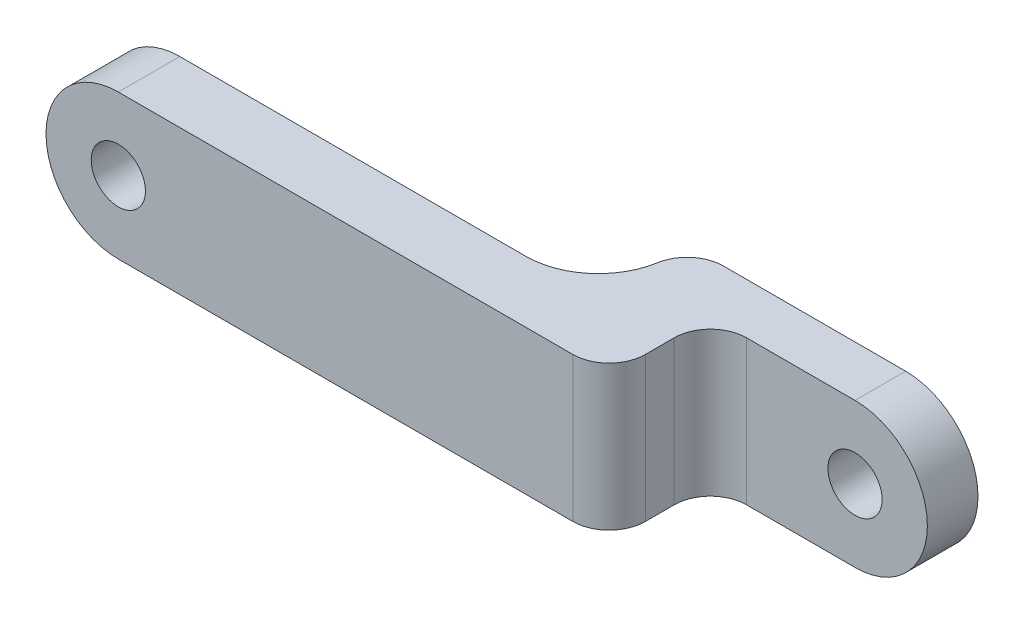
ISO-10303-21;
HEADER;
FILE_DESCRIPTION(('STEP AP214'),'2;1');
FILE_NAME('part.step','',(''),(''),'','','');
FILE_SCHEMA(('AUTOMOTIVE_DESIGN { 1 0 10303 214 1 1 1 1 }'));
ENDSEC;
DATA;
#1=APPLICATION_CONTEXT('core data for automotive mechanical design processes');
#2=APPLICATION_PROTOCOL_DEFINITION('international standard','automotive_design',2000,#1);
#3=PRODUCT_CONTEXT('',#1,'mechanical');
#4=PRODUCT('Part','Part','',(#3));
#5=PRODUCT_RELATED_PRODUCT_CATEGORY('part','',(#4));
#6=PRODUCT_DEFINITION_FORMATION('','',#4);
#7=PRODUCT_DEFINITION_CONTEXT('part definition',#1,'design');
#8=PRODUCT_DEFINITION('design','',#6,#7);
#9=PRODUCT_DEFINITION_SHAPE('','',#8);
#10=(LENGTH_UNIT() NAMED_UNIT(*) SI_UNIT(.MILLI.,.METRE.));
#11=(NAMED_UNIT(*) PLANE_ANGLE_UNIT() SI_UNIT($,.RADIAN.));
#12=(NAMED_UNIT(*) SI_UNIT($,.STERADIAN.) SOLID_ANGLE_UNIT());
#13=UNCERTAINTY_MEASURE_WITH_UNIT(LENGTH_MEASURE(1.E-05),#10,'distance_accuracy_value','');
#14=(GEOMETRIC_REPRESENTATION_CONTEXT(3) GLOBAL_UNCERTAINTY_ASSIGNED_CONTEXT((#13)) GLOBAL_UNIT_ASSIGNED_CONTEXT((#10,
#11,#12)) REPRESENTATION_CONTEXT('',''));
#15=CARTESIAN_POINT('',(0.,0.,0.));
#16=DIRECTION('',(0.,0.,1.));
#17=DIRECTION('',(1.,0.,0.));
#18=AXIS2_PLACEMENT_3D('',#15,#16,#17);
#19=CARTESIAN_POINT('',(0.,0.,0.85));
#20=DIRECTION('',(0.,0.,-1.));
#21=DIRECTION('',(1.,0.,0.));
#22=AXIS2_PLACEMENT_3D('',#19,#20,#21);
#23=CYLINDRICAL_SURFACE('',#22,2.);
#24=CARTESIAN_POINT('',(0.,0.,-1.95));
#25=DIRECTION('',(0.,0.,-1.));
#26=DIRECTION('',(-1.,0.,0.));
#27=AXIS2_PLACEMENT_3D('',#24,#25,#26);
#28=CIRCLE('',#27,2.);
#29=CARTESIAN_POINT('',(0.,2.,-1.95));
#30=VERTEX_POINT('',#29);
#31=CARTESIAN_POINT('',(0.,-2.,-1.95));
#32=VERTEX_POINT('',#31);
#33=EDGE_CURVE('E127',#30,#32,#28,.T.);
#34=ORIENTED_EDGE('',*,*,#33,.T.);
#35=DIRECTION('',(0.,0.,-1.));
#36=VECTOR('',#35,1.);
#37=CARTESIAN_POINT('',(0.,-2.,0.85));
#38=LINE('',#37,#36);
#39=CARTESIAN_POINT('',(0.,-2.,-3.35));
#40=VERTEX_POINT('',#39);
#41=EDGE_CURVE('E133',#32,#40,#38,.T.);
#42=ORIENTED_EDGE('',*,*,#41,.T.);
#43=CARTESIAN_POINT('',(0.,0.,-3.35));
#44=DIRECTION('',(0.,0.,1.));
#45=DIRECTION('',(1.,0.,0.));
#46=AXIS2_PLACEMENT_3D('',#43,#44,#45);
#47=CIRCLE('',#46,2.);
#48=CARTESIAN_POINT('',(0.,2.,-3.35));
#49=VERTEX_POINT('',#48);
#50=EDGE_CURVE('E161',#40,#49,#47,.T.);
#51=ORIENTED_EDGE('',*,*,#50,.T.);
#52=DIRECTION('',(0.,0.,-1.));
#53=VECTOR('',#52,1.);
#54=CARTESIAN_POINT('',(0.,2.,0.85));
#55=LINE('',#54,#53);
#56=EDGE_CURVE('E146',#30,#49,#55,.T.);
#57=ORIENTED_EDGE('',*,*,#56,.F.);
#58=EDGE_LOOP('',(#34,#42,#51,#57));
#59=FACE_BOUND('',#58,.T.);
#60=ADVANCED_FACE('F37',(#59),#23,.T.);
#61=CARTESIAN_POINT('',(0.,0.,0.85));
#62=DIRECTION('',(0.,0.,-1.));
#63=DIRECTION('',(1.,0.,0.));
#64=AXIS2_PLACEMENT_3D('',#61,#62,#63);
#65=CYLINDRICAL_SURFACE('',#64,0.75);
#66=CARTESIAN_POINT('',(0.,0.,-3.35));
#67=DIRECTION('',(0.,0.,1.));
#68=DIRECTION('',(1.,0.,0.));
#69=AXIS2_PLACEMENT_3D('',#66,#67,#68);
#70=CIRCLE('',#69,0.75);
#71=CARTESIAN_POINT('',(0.75,0.,-3.35));
#72=VERTEX_POINT('',#71);
#73=EDGE_CURVE('E157',#72,#72,#70,.T.);
#74=ORIENTED_EDGE('',*,*,#73,.F.);
#75=EDGE_LOOP('',(#74));
#76=FACE_BOUND('',#75,.T.);
#77=CARTESIAN_POINT('',(0.,0.,-1.95));
#78=DIRECTION('',(0.,0.,-1.));
#79=DIRECTION('',(-1.,0.,0.));
#80=AXIS2_PLACEMENT_3D('',#77,#78,#79);
#81=CIRCLE('',#80,0.75);
#82=CARTESIAN_POINT('',(-0.75,0.,-1.95));
#83=VERTEX_POINT('',#82);
#84=EDGE_CURVE('E147',#83,#83,#81,.T.);
#85=ORIENTED_EDGE('',*,*,#84,.F.);
#86=EDGE_LOOP('',(#85));
#87=FACE_BOUND('',#86,.T.);
#88=ADVANCED_FACE('F257',(#76,#87),#65,.F.);
#89=CARTESIAN_POINT('',(0.,0.,-0.85));
#90=DIRECTION('',(0.,0.,1.));
#91=DIRECTION('',(-1.,0.,0.));
#92=AXIS2_PLACEMENT_3D('',#89,#90,#91);
#93=PLANE('',#92);
#94=CARTESIAN_POINT('',(-17.57,0.,-0.85));
#95=DIRECTION('',(0.,0.,-1.));
#96=DIRECTION('',(-1.,0.,0.));
#97=AXIS2_PLACEMENT_3D('',#94,#95,#96);
#98=CIRCLE('',#97,0.750000000000002);
#99=CARTESIAN_POINT('',(-18.32,0.,-0.85));
#100=VERTEX_POINT('',#99);
#101=EDGE_CURVE('E167',#100,#100,#98,.T.);
#102=ORIENTED_EDGE('',*,*,#101,.F.);
#103=EDGE_LOOP('',(#102));
#104=FACE_BOUND('',#103,.T.);
#105=DIRECTION('',(-1.,0.,0.));
#106=VECTOR('',#105,1.);
#107=CARTESIAN_POINT('',(0.,-2.,-0.85));
#108=LINE('',#107,#106);
#109=CARTESIAN_POINT('',(-8.,-2.,-0.85));
#110=VERTEX_POINT('',#109);
#111=CARTESIAN_POINT('',(-17.57,-2.,-0.85));
#112=VERTEX_POINT('',#111);
#113=EDGE_CURVE('E171',#110,#112,#108,.T.);
#114=ORIENTED_EDGE('',*,*,#113,.T.);
#115=CARTESIAN_POINT('',(-17.57,0.,-0.85));
#116=DIRECTION('',(0.,0.,-1.));
#117=DIRECTION('',(-1.,0.,0.));
#118=AXIS2_PLACEMENT_3D('',#115,#116,#117);
#119=CIRCLE('',#118,2.);
#120=CARTESIAN_POINT('',(-17.57,2.,-0.85));
#121=VERTEX_POINT('',#120);
#122=EDGE_CURVE('E185',#112,#121,#119,.T.);
#123=ORIENTED_EDGE('',*,*,#122,.T.);
#124=DIRECTION('',(1.,0.,0.));
#125=VECTOR('',#124,1.);
#126=CARTESIAN_POINT('',(0.,2.,-0.85));
#127=LINE('',#126,#125);
#128=CARTESIAN_POINT('',(-8.,2.,-0.85));
#129=VERTEX_POINT('',#128);
#130=EDGE_CURVE('E177',#121,#129,#127,.T.);
#131=ORIENTED_EDGE('',*,*,#130,.T.);
#132=DIRECTION('',(0.,-1.,0.));
#133=VECTOR('',#132,1.);
#134=CARTESIAN_POINT('',(-8.,2.,-0.85));
#135=LINE('',#134,#133);
#136=EDGE_CURVE('E141',#110,#129,#135,.F.);
#137=ORIENTED_EDGE('',*,*,#136,.F.);
#138=EDGE_LOOP('',(#114,#123,#131,#137));
#139=FACE_BOUND('',#138,.T.);
#140=ADVANCED_FACE('F243',(#104,#139),#93,.F.);
#141=CARTESIAN_POINT('',(0.,0.,0.85));
#142=DIRECTION('',(0.,0.,1.));
#143=DIRECTION('',(-1.,0.,0.));
#144=AXIS2_PLACEMENT_3D('',#141,#142,#143);
#145=PLANE('',#144);
#146=DIRECTION('',(1.,0.,0.));
#147=VECTOR('',#146,1.);
#148=CARTESIAN_POINT('',(0.,2.,0.85));
#149=LINE('',#148,#147);
#150=CARTESIAN_POINT('',(-17.57,2.,0.85));
#151=VERTEX_POINT('',#150);
#152=CARTESIAN_POINT('',(-5.,2.,0.85));
#153=VERTEX_POINT('',#152);
#154=EDGE_CURVE('E180',#151,#153,#149,.T.);
#155=ORIENTED_EDGE('',*,*,#154,.F.);
#156=CARTESIAN_POINT('',(-17.57,0.,0.85));
#157=DIRECTION('',(0.,0.,-1.));
#158=DIRECTION('',(-1.,0.,0.));
#159=AXIS2_PLACEMENT_3D('',#156,#157,#158);
#160=CIRCLE('',#159,2.);
#161=CARTESIAN_POINT('',(-17.57,-2.,0.85));
#162=VERTEX_POINT('',#161);
#163=EDGE_CURVE('E176',#162,#151,#160,.T.);
#164=ORIENTED_EDGE('',*,*,#163,.F.);
#165=DIRECTION('',(-1.,0.,0.));
#166=VECTOR('',#165,1.);
#167=CARTESIAN_POINT('',(0.,-2.,0.85));
#168=LINE('',#167,#166);
#169=CARTESIAN_POINT('',(-5.,-2.,0.85));
#170=VERTEX_POINT('',#169);
#171=EDGE_CURVE('E174',#170,#162,#168,.T.);
#172=ORIENTED_EDGE('',*,*,#171,.F.);
#173=DIRECTION('',(0.,1.,0.));
#174=VECTOR('',#173,1.);
#175=CARTESIAN_POINT('',(-5.,-2.,0.85));
#176=LINE('',#175,#174);
#177=EDGE_CURVE('E217',#153,#170,#176,.F.);
#178=ORIENTED_EDGE('',*,*,#177,.F.);
#179=EDGE_LOOP('',(#155,#164,#172,#178));
#180=FACE_BOUND('',#179,.T.);
#181=CARTESIAN_POINT('',(-17.57,0.,0.85));
#182=DIRECTION('',(0.,0.,-1.));
#183=DIRECTION('',(-1.,0.,0.));
#184=AXIS2_PLACEMENT_3D('',#181,#182,#183);
#185=CIRCLE('',#184,0.750000000000002);
#186=CARTESIAN_POINT('',(-18.32,0.,0.85));
#187=VERTEX_POINT('',#186);
#188=EDGE_CURVE('E168',#187,#187,#185,.T.);
#189=ORIENTED_EDGE('',*,*,#188,.T.);
#190=EDGE_LOOP('',(#189));
#191=FACE_BOUND('',#190,.T.);
#192=ADVANCED_FACE('F233',(#180,#191),#145,.T.);
#193=CARTESIAN_POINT('',(0.,-2.,0.85));
#194=DIRECTION('',(0.,1.,0.));
#195=DIRECTION('',(0.,0.,1.));
#196=AXIS2_PLACEMENT_3D('',#193,#194,#195);
#197=PLANE('',#196);
#198=ORIENTED_EDGE('',*,*,#171,.T.);
#199=DIRECTION('',(0.,0.,-1.));
#200=VECTOR('',#199,1.);
#201=CARTESIAN_POINT('',(-17.57,-2.,0.85));
#202=LINE('',#201,#200);
#203=EDGE_CURVE('E142',#162,#112,#202,.T.);
#204=ORIENTED_EDGE('',*,*,#203,.T.);
#205=ORIENTED_EDGE('',*,*,#113,.F.);
#206=CARTESIAN_POINT('',(-8.,-2.,-2.85));
#207=DIRECTION('',(0.,-1.,0.));
#208=DIRECTION('',(0.,0.,1.));
#209=AXIS2_PLACEMENT_3D('',#206,#207,#208);
#210=CIRCLE('',#209,2.);
#211=CARTESIAN_POINT('',(-6.02797340563346,-2.,-2.51666666666667));
#212=VERTEX_POINT('',#211);
#213=EDGE_CURVE('E196',#212,#110,#210,.T.);
#214=ORIENTED_EDGE('',*,*,#213,.F.);
#215=CARTESIAN_POINT('',(-5.04196010845019,-2.,-2.35));
#216=DIRECTION('',(0.,-1.,0.));
#217=DIRECTION('',(0.,0.,1.));
#218=AXIS2_PLACEMENT_3D('',#215,#216,#217);
#219=CIRCLE('',#218,1.);
#220=CARTESIAN_POINT('',(-5.04196010845019,-2.,-3.35));
#221=VERTEX_POINT('',#220);
#222=EDGE_CURVE('E203',#221,#212,#219,.F.);
#223=ORIENTED_EDGE('',*,*,#222,.F.);
#224=DIRECTION('',(1.,0.,0.));
#225=VECTOR('',#224,1.);
#226=CARTESIAN_POINT('',(-6.,-2.,-3.35));
#227=LINE('',#226,#225);
#228=EDGE_CURVE('E137',#221,#40,#227,.T.);
#229=ORIENTED_EDGE('',*,*,#228,.T.);
#230=ORIENTED_EDGE('',*,*,#41,.F.);
#231=DIRECTION('',(-1.,0.,0.));
#232=VECTOR('',#231,1.);
#233=CARTESIAN_POINT('',(0.,-2.,-1.95));
#234=LINE('',#233,#232);
#235=CARTESIAN_POINT('',(-3.,-2.,-1.95));
#236=VERTEX_POINT('',#235);
#237=EDGE_CURVE('E122',#32,#236,#234,.T.);
#238=ORIENTED_EDGE('',*,*,#237,.T.);
#239=CARTESIAN_POINT('',(-3.,-2.,-0.95));
#240=DIRECTION('',(0.,-1.,0.));
#241=DIRECTION('',(0.,0.,1.));
#242=AXIS2_PLACEMENT_3D('',#239,#240,#241);
#243=CIRCLE('',#242,1.);
#244=CARTESIAN_POINT('',(-4.,-2.,-0.95));
#245=VERTEX_POINT('',#244);
#246=EDGE_CURVE('E11',#245,#236,#243,.T.);
#247=ORIENTED_EDGE('',*,*,#246,.F.);
#248=DIRECTION('',(0.,0.,1.));
#249=VECTOR('',#248,1.);
#250=CARTESIAN_POINT('',(-4.,-2.,-1.95));
#251=LINE('',#250,#249);
#252=CARTESIAN_POINT('',(-4.,-2.,-0.15));
#253=VERTEX_POINT('',#252);
#254=EDGE_CURVE('E153',#245,#253,#251,.T.);
#255=ORIENTED_EDGE('',*,*,#254,.T.);
#256=CARTESIAN_POINT('',(-5.,-2.,-0.15));
#257=DIRECTION('',(0.,-1.,0.));
#258=DIRECTION('',(0.,0.,1.));
#259=AXIS2_PLACEMENT_3D('',#256,#257,#258);
#260=CIRCLE('',#259,1.);
#261=EDGE_CURVE('E52',#170,#253,#260,.F.);
#262=ORIENTED_EDGE('',*,*,#261,.F.);
#263=EDGE_LOOP('',(#198,#204,#205,#214,#223,#229,#230,#238,#247,#255,#262));
#264=FACE_BOUND('',#263,.T.);
#265=ADVANCED_FACE('F134',(#264),#197,.F.);
#266=CARTESIAN_POINT('',(-17.57,0.,0.85));
#267=DIRECTION('',(0.,0.,-1.));
#268=DIRECTION('',(1.,0.,0.));
#269=AXIS2_PLACEMENT_3D('',#266,#267,#268);
#270=CYLINDRICAL_SURFACE('',#269,2.);
#271=ORIENTED_EDGE('',*,*,#122,.F.);
#272=ORIENTED_EDGE('',*,*,#203,.F.);
#273=ORIENTED_EDGE('',*,*,#163,.T.);
#274=DIRECTION('',(0.,0.,-1.));
#275=VECTOR('',#274,1.);
#276=CARTESIAN_POINT('',(-17.57,2.,0.85));
#277=LINE('',#276,#275);
#278=EDGE_CURVE('E191',#151,#121,#277,.T.);
#279=ORIENTED_EDGE('',*,*,#278,.T.);
#280=EDGE_LOOP('',(#271,#272,#273,#279));
#281=FACE_BOUND('',#280,.T.);
#282=ADVANCED_FACE('F239',(#281),#270,.T.);
#283=CARTESIAN_POINT('',(0.,2.,0.85));
#284=DIRECTION('',(0.,-1.,0.));
#285=DIRECTION('',(0.,0.,-1.));
#286=AXIS2_PLACEMENT_3D('',#283,#284,#285);
#287=PLANE('',#286);
#288=DIRECTION('',(0.,0.,1.));
#289=VECTOR('',#288,1.);
#290=CARTESIAN_POINT('',(-4.,2.,-1.95));
#291=LINE('',#290,#289);
#292=CARTESIAN_POINT('',(-4.,2.,-0.95));
#293=VERTEX_POINT('',#292);
#294=CARTESIAN_POINT('',(-4.,2.,-0.15));
#295=VERTEX_POINT('',#294);
#296=EDGE_CURVE('E154',#293,#295,#291,.T.);
#297=ORIENTED_EDGE('',*,*,#296,.F.);
#298=CARTESIAN_POINT('',(-3.,2.,-0.95));
#299=DIRECTION('',(0.,1.,0.));
#300=DIRECTION('',(0.,0.,-1.));
#301=AXIS2_PLACEMENT_3D('',#298,#299,#300);
#302=CIRCLE('',#301,1.);
#303=CARTESIAN_POINT('',(-3.,2.,-1.95));
#304=VERTEX_POINT('',#303);
#305=EDGE_CURVE('E45',#304,#293,#302,.T.);
#306=ORIENTED_EDGE('',*,*,#305,.F.);
#307=DIRECTION('',(1.,0.,0.));
#308=VECTOR('',#307,1.);
#309=CARTESIAN_POINT('',(-4.,2.,-1.95));
#310=LINE('',#309,#308);
#311=EDGE_CURVE('E130',#304,#30,#310,.T.);
#312=ORIENTED_EDGE('',*,*,#311,.T.);
#313=ORIENTED_EDGE('',*,*,#56,.T.);
#314=DIRECTION('',(-1.,0.,0.));
#315=VECTOR('',#314,1.);
#316=CARTESIAN_POINT('',(0.,2.,-3.35));
#317=LINE('',#316,#315);
#318=CARTESIAN_POINT('',(-5.04196010845019,2.,-3.35));
#319=VERTEX_POINT('',#318);
#320=EDGE_CURVE('E163',#49,#319,#317,.T.);
#321=ORIENTED_EDGE('',*,*,#320,.T.);
#322=CARTESIAN_POINT('',(-5.04196010845019,2.,-2.35));
#323=DIRECTION('',(0.,1.,0.));
#324=DIRECTION('',(0.,0.,-1.));
#325=AXIS2_PLACEMENT_3D('',#322,#323,#324);
#326=CIRCLE('',#325,1.);
#327=CARTESIAN_POINT('',(-6.02797340563346,2.,-2.51666666666667));
#328=VERTEX_POINT('',#327);
#329=EDGE_CURVE('E208',#328,#319,#326,.F.);
#330=ORIENTED_EDGE('',*,*,#329,.F.);
#331=CARTESIAN_POINT('',(-8.,2.,-2.85));
#332=DIRECTION('',(0.,1.,0.));
#333=DIRECTION('',(0.,0.,-1.));
#334=AXIS2_PLACEMENT_3D('',#331,#332,#333);
#335=CIRCLE('',#334,2.);
#336=EDGE_CURVE('E198',#129,#328,#335,.T.);
#337=ORIENTED_EDGE('',*,*,#336,.F.);
#338=ORIENTED_EDGE('',*,*,#130,.F.);
#339=ORIENTED_EDGE('',*,*,#278,.F.);
#340=ORIENTED_EDGE('',*,*,#154,.T.);
#341=CARTESIAN_POINT('',(-5.,2.,-0.15));
#342=DIRECTION('',(0.,1.,0.));
#343=DIRECTION('',(0.,0.,-1.));
#344=AXIS2_PLACEMENT_3D('',#341,#342,#343);
#345=CIRCLE('',#344,1.);
#346=EDGE_CURVE('E59',#295,#153,#345,.F.);
#347=ORIENTED_EDGE('',*,*,#346,.F.);
#348=EDGE_LOOP('',(#297,#306,#312,#313,#321,#330,#337,#338,#339,#340,#347));
#349=FACE_BOUND('',#348,.T.);
#350=ADVANCED_FACE('F226',(#349),#287,.F.);
#351=CARTESIAN_POINT('',(-17.57,0.,0.85));
#352=DIRECTION('',(0.,0.,-1.));
#353=DIRECTION('',(1.,0.,0.));
#354=AXIS2_PLACEMENT_3D('',#351,#352,#353);
#355=CYLINDRICAL_SURFACE('',#354,0.750000000000002);
#356=ORIENTED_EDGE('',*,*,#188,.F.);
#357=EDGE_LOOP('',(#356));
#358=FACE_BOUND('',#357,.T.);
#359=ORIENTED_EDGE('',*,*,#101,.T.);
#360=EDGE_LOOP('',(#359));
#361=FACE_BOUND('',#360,.T.);
#362=ADVANCED_FACE('F253',(#358,#361),#355,.F.);
#363=CARTESIAN_POINT('',(0.,0.,-3.35));
#364=DIRECTION('',(0.,0.,-1.));
#365=DIRECTION('',(1.,0.,0.));
#366=AXIS2_PLACEMENT_3D('',#363,#364,#365);
#367=PLANE('',#366);
#368=ORIENTED_EDGE('',*,*,#320,.F.);
#369=ORIENTED_EDGE('',*,*,#50,.F.);
#370=ORIENTED_EDGE('',*,*,#228,.F.);
#371=DIRECTION('',(0.,-1.,0.));
#372=VECTOR('',#371,1.);
#373=CARTESIAN_POINT('',(-5.04196010845019,-2.,-3.35));
#374=LINE('',#373,#372);
#375=EDGE_CURVE('E201',#319,#221,#374,.T.);
#376=ORIENTED_EDGE('',*,*,#375,.F.);
#377=EDGE_LOOP('',(#368,#369,#370,#376));
#378=FACE_BOUND('',#377,.T.);
#379=ORIENTED_EDGE('',*,*,#73,.T.);
#380=EDGE_LOOP('',(#379));
#381=FACE_BOUND('',#380,.T.);
#382=ADVANCED_FACE('F250',(#378,#381),#367,.T.);
#383=CARTESIAN_POINT('',(-4.,2.,-1.95));
#384=DIRECTION('',(-1.,0.,0.));
#385=DIRECTION('',(0.,0.,-1.));
#386=AXIS2_PLACEMENT_3D('',#383,#384,#385);
#387=PLANE('',#386);
#388=ORIENTED_EDGE('',*,*,#296,.T.);
#389=DIRECTION('',(0.,1.,0.));
#390=VECTOR('',#389,1.);
#391=CARTESIAN_POINT('',(-4.,2.,-0.15));
#392=LINE('',#391,#390);
#393=EDGE_CURVE('E212',#253,#295,#392,.T.);
#394=ORIENTED_EDGE('',*,*,#393,.F.);
#395=ORIENTED_EDGE('',*,*,#254,.F.);
#396=DIRECTION('',(0.,1.,0.));
#397=VECTOR('',#396,1.);
#398=CARTESIAN_POINT('',(-4.,2.,-0.95));
#399=LINE('',#398,#397);
#400=EDGE_CURVE('E214',#293,#245,#399,.F.);
#401=ORIENTED_EDGE('',*,*,#400,.F.);
#402=EDGE_LOOP('',(#388,#394,#395,#401));
#403=FACE_BOUND('',#402,.T.);
#404=ADVANCED_FACE('F228',(#403),#387,.F.);
#405=CARTESIAN_POINT('',(0.,0.,-1.95));
#406=DIRECTION('',(0.,0.,1.));
#407=DIRECTION('',(-1.,0.,0.));
#408=AXIS2_PLACEMENT_3D('',#405,#406,#407);
#409=PLANE('',#408);
#410=ORIENTED_EDGE('',*,*,#84,.T.);
#411=EDGE_LOOP('',(#410));
#412=FACE_BOUND('',#411,.T.);
#413=ORIENTED_EDGE('',*,*,#237,.F.);
#414=ORIENTED_EDGE('',*,*,#33,.F.);
#415=ORIENTED_EDGE('',*,*,#311,.F.);
#416=DIRECTION('',(0.,1.,0.));
#417=VECTOR('',#416,1.);
#418=CARTESIAN_POINT('',(-3.,0.,-1.95));
#419=LINE('',#418,#417);
#420=EDGE_CURVE('E128',#236,#304,#419,.T.);
#421=ORIENTED_EDGE('',*,*,#420,.F.);
#422=EDGE_LOOP('',(#413,#414,#415,#421));
#423=FACE_BOUND('',#422,.T.);
#424=ADVANCED_FACE('F124',(#412,#423),#409,.T.);
#425=CARTESIAN_POINT('',(-8.,2.,-2.85));
#426=DIRECTION('',(0.,1.,0.));
#427=DIRECTION('',(0.,0.,1.));
#428=AXIS2_PLACEMENT_3D('',#425,#426,#427);
#429=CYLINDRICAL_SURFACE('',#428,2.);
#430=ORIENTED_EDGE('',*,*,#213,.T.);
#431=ORIENTED_EDGE('',*,*,#136,.T.);
#432=ORIENTED_EDGE('',*,*,#336,.T.);
#433=DIRECTION('',(0.,1.,0.));
#434=VECTOR('',#433,1.);
#435=CARTESIAN_POINT('',(-6.02797340563346,2.,-2.51666666666667));
#436=LINE('',#435,#434);
#437=EDGE_CURVE('E206',#212,#328,#436,.T.);
#438=ORIENTED_EDGE('',*,*,#437,.F.);
#439=EDGE_LOOP('',(#430,#431,#432,#438));
#440=FACE_BOUND('',#439,.T.);
#441=ADVANCED_FACE('F245',(#440),#429,.F.);
#442=CARTESIAN_POINT('',(-5.04196010845019,2.,-2.35));
#443=DIRECTION('',(0.,1.,0.));
#444=DIRECTION('',(0.,0.,1.));
#445=AXIS2_PLACEMENT_3D('',#442,#443,#444);
#446=CYLINDRICAL_SURFACE('',#445,1.);
#447=ORIENTED_EDGE('',*,*,#329,.T.);
#448=ORIENTED_EDGE('',*,*,#375,.T.);
#449=ORIENTED_EDGE('',*,*,#222,.T.);
#450=ORIENTED_EDGE('',*,*,#437,.T.);
#451=EDGE_LOOP('',(#447,#448,#449,#450));
#452=FACE_BOUND('',#451,.T.);
#453=ADVANCED_FACE('F248',(#452),#446,.T.);
#454=CARTESIAN_POINT('',(-3.,0.,-0.95));
#455=DIRECTION('',(0.,1.,0.));
#456=DIRECTION('',(0.,0.,1.));
#457=AXIS2_PLACEMENT_3D('',#454,#455,#456);
#458=CYLINDRICAL_SURFACE('',#457,1.);
#459=ORIENTED_EDGE('',*,*,#246,.T.);
#460=ORIENTED_EDGE('',*,*,#420,.T.);
#461=ORIENTED_EDGE('',*,*,#305,.T.);
#462=ORIENTED_EDGE('',*,*,#400,.T.);
#463=EDGE_LOOP('',(#459,#460,#461,#462));
#464=FACE_BOUND('',#463,.T.);
#465=ADVANCED_FACE('F223',(#464),#458,.F.);
#466=CARTESIAN_POINT('',(-5.,2.,-0.15));
#467=DIRECTION('',(0.,-1.,0.));
#468=DIRECTION('',(0.,0.,-1.));
#469=AXIS2_PLACEMENT_3D('',#466,#467,#468);
#470=CYLINDRICAL_SURFACE('',#469,1.);
#471=ORIENTED_EDGE('',*,*,#261,.T.);
#472=ORIENTED_EDGE('',*,*,#393,.T.);
#473=ORIENTED_EDGE('',*,*,#346,.T.);
#474=ORIENTED_EDGE('',*,*,#177,.T.);
#475=EDGE_LOOP('',(#471,#472,#473,#474));
#476=FACE_BOUND('',#475,.T.);
#477=ADVANCED_FACE('F39',(#476),#470,.T.);
#478=CLOSED_SHELL('',(#60,#88,#140,#192,#265,#282,#350,#362,#382,#404,#424,#441,#453,#465,#477));
#479=MANIFOLD_SOLID_BREP('B2',#478);
#480=ADVANCED_BREP_SHAPE_REPRESENTATION('',(#18,#479),#14);
#481=SHAPE_DEFINITION_REPRESENTATION(#9,#480);
ENDSEC;
END-ISO-10303-21;
